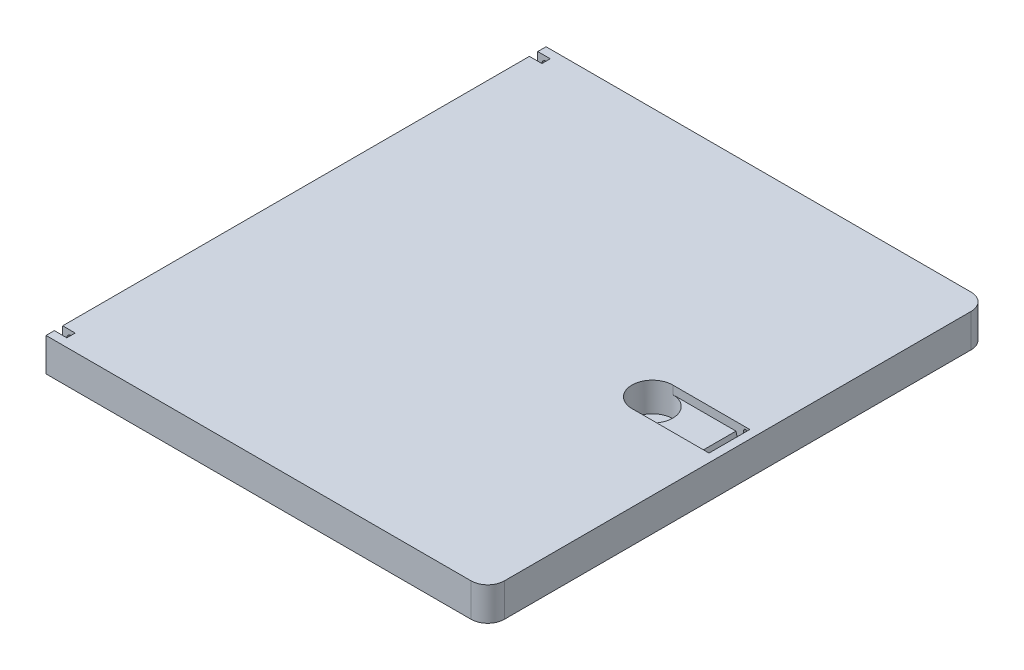
ISO-10303-21;
HEADER;
FILE_DESCRIPTION(('STEP AP214'),'2;1');
FILE_NAME('part.step','',(''),(''),'','','');
FILE_SCHEMA(('AUTOMOTIVE_DESIGN { 1 0 10303 214 1 1 1 1 }'));
ENDSEC;
DATA;
#1=APPLICATION_CONTEXT('core data for automotive mechanical design processes');
#2=APPLICATION_PROTOCOL_DEFINITION('international standard','automotive_design',2000,#1);
#3=PRODUCT_CONTEXT('',#1,'mechanical');
#4=PRODUCT('Part','Part','',(#3));
#5=PRODUCT_RELATED_PRODUCT_CATEGORY('part','',(#4));
#6=PRODUCT_DEFINITION_FORMATION('','',#4);
#7=PRODUCT_DEFINITION_CONTEXT('part definition',#1,'design');
#8=PRODUCT_DEFINITION('design','',#6,#7);
#9=PRODUCT_DEFINITION_SHAPE('','',#8);
#10=(LENGTH_UNIT() NAMED_UNIT(*) SI_UNIT(.MILLI.,.METRE.));
#11=(NAMED_UNIT(*) PLANE_ANGLE_UNIT() SI_UNIT($,.RADIAN.));
#12=(NAMED_UNIT(*) SI_UNIT($,.STERADIAN.) SOLID_ANGLE_UNIT());
#13=UNCERTAINTY_MEASURE_WITH_UNIT(LENGTH_MEASURE(1.E-05),#10,'distance_accuracy_value','');
#14=(GEOMETRIC_REPRESENTATION_CONTEXT(3) GLOBAL_UNCERTAINTY_ASSIGNED_CONTEXT((#13)) GLOBAL_UNIT_ASSIGNED_CONTEXT((#10,
#11,#12)) REPRESENTATION_CONTEXT('',''));
#15=CARTESIAN_POINT('',(0.,0.,0.));
#16=DIRECTION('',(0.,0.,1.));
#17=DIRECTION('',(1.,0.,0.));
#18=AXIS2_PLACEMENT_3D('',#15,#16,#17);
#19=CARTESIAN_POINT('',(0.,0.,-56.));
#20=DIRECTION('',(0.,0.,1.));
#21=DIRECTION('',(-1.,0.,0.));
#22=AXIS2_PLACEMENT_3D('',#19,#20,#21);
#23=PLANE('',#22);
#24=DIRECTION('',(0.,-1.,0.));
#25=VECTOR('',#24,1.);
#26=CARTESIAN_POINT('',(-103.,0.,-56.));
#27=LINE('',#26,#25);
#28=CARTESIAN_POINT('',(-103.,0.,-56.));
#29=VERTEX_POINT('',#28);
#30=CARTESIAN_POINT('',(-103.,-2.,-56.));
#31=VERTEX_POINT('',#30);
#32=EDGE_CURVE('E271',#29,#31,#27,.T.);
#33=ORIENTED_EDGE('',*,*,#32,.T.);
#34=CARTESIAN_POINT('',(-104.,-2.,-56.));
#35=DIRECTION('',(0.,0.,1.));
#36=DIRECTION('',(1.,0.,0.));
#37=AXIS2_PLACEMENT_3D('',#34,#35,#36);
#38=CIRCLE('',#37,0.999999999999998);
#39=CARTESIAN_POINT('',(-104.,-3.,-56.));
#40=VERTEX_POINT('',#39);
#41=EDGE_CURVE('E46',#31,#40,#38,.T.);
#42=ORIENTED_EDGE('',*,*,#41,.T.);
#43=DIRECTION('',(1.,0.,0.));
#44=VECTOR('',#43,1.);
#45=CARTESIAN_POINT('',(-106.,-3.,-56.));
#46=LINE('',#45,#44);
#47=CARTESIAN_POINT('',(-106.,-3.,-56.));
#48=VERTEX_POINT('',#47);
#49=EDGE_CURVE('E527',#48,#40,#46,.T.);
#50=ORIENTED_EDGE('',*,*,#49,.F.);
#51=DIRECTION('',(0.,-1.,0.));
#52=VECTOR('',#51,1.);
#53=CARTESIAN_POINT('',(-106.,0.,-56.));
#54=LINE('',#53,#52);
#55=CARTESIAN_POINT('',(-106.,0.,-56.));
#56=VERTEX_POINT('',#55);
#57=EDGE_CURVE('E264',#56,#48,#54,.T.);
#58=ORIENTED_EDGE('',*,*,#57,.F.);
#59=DIRECTION('',(1.,0.,0.));
#60=VECTOR('',#59,1.);
#61=CARTESIAN_POINT('',(-106.,0.,-56.));
#62=LINE('',#61,#60);
#63=EDGE_CURVE('E263',#56,#29,#62,.T.);
#64=ORIENTED_EDGE('',*,*,#63,.T.);
#65=EDGE_LOOP('',(#33,#42,#50,#58,#64));
#66=FACE_BOUND('',#65,.T.);
#67=ADVANCED_FACE('F32',(#66),#23,.F.);
#68=CARTESIAN_POINT('',(0.,0.,-58.));
#69=DIRECTION('',(0.,0.,1.));
#70=DIRECTION('',(-1.,0.,0.));
#71=AXIS2_PLACEMENT_3D('',#68,#69,#70);
#72=PLANE('',#71);
#73=CARTESIAN_POINT('',(-104.,-2.,-58.));
#74=DIRECTION('',(0.,0.,1.));
#75=DIRECTION('',(1.,0.,0.));
#76=AXIS2_PLACEMENT_3D('',#73,#74,#75);
#77=CIRCLE('',#76,0.999999999999998);
#78=CARTESIAN_POINT('',(-103.,-2.,-58.));
#79=VERTEX_POINT('',#78);
#80=CARTESIAN_POINT('',(-104.,-3.,-58.));
#81=VERTEX_POINT('',#80);
#82=EDGE_CURVE('E11',#79,#81,#77,.T.);
#83=ORIENTED_EDGE('',*,*,#82,.F.);
#84=DIRECTION('',(0.,-1.,0.));
#85=VECTOR('',#84,1.);
#86=CARTESIAN_POINT('',(-103.,0.,-58.));
#87=LINE('',#86,#85);
#88=CARTESIAN_POINT('',(-103.,0.,-58.));
#89=VERTEX_POINT('',#88);
#90=EDGE_CURVE('E247',#89,#79,#87,.T.);
#91=ORIENTED_EDGE('',*,*,#90,.F.);
#92=DIRECTION('',(1.,0.,0.));
#93=VECTOR('',#92,1.);
#94=CARTESIAN_POINT('',(-106.,0.,-58.));
#95=LINE('',#94,#93);
#96=CARTESIAN_POINT('',(-106.,0.,-58.));
#97=VERTEX_POINT('',#96);
#98=EDGE_CURVE('E535',#97,#89,#95,.T.);
#99=ORIENTED_EDGE('',*,*,#98,.F.);
#100=DIRECTION('',(0.,-1.,0.));
#101=VECTOR('',#100,1.);
#102=CARTESIAN_POINT('',(-106.,0.,-58.));
#103=LINE('',#102,#101);
#104=CARTESIAN_POINT('',(-106.,-3.,-58.));
#105=VERTEX_POINT('',#104);
#106=EDGE_CURVE('E536',#97,#105,#103,.T.);
#107=ORIENTED_EDGE('',*,*,#106,.T.);
#108=DIRECTION('',(1.,0.,0.));
#109=VECTOR('',#108,1.);
#110=CARTESIAN_POINT('',(-106.,-3.,-58.));
#111=LINE('',#110,#109);
#112=EDGE_CURVE('E250',#105,#81,#111,.T.);
#113=ORIENTED_EDGE('',*,*,#112,.T.);
#114=EDGE_LOOP('',(#83,#91,#99,#107,#113));
#115=FACE_BOUND('',#114,.T.);
#116=ADVANCED_FACE('F245',(#115),#72,.T.);
#117=CARTESIAN_POINT('',(0.,0.,56.));
#118=DIRECTION('',(0.,0.,-1.));
#119=DIRECTION('',(-1.,0.,0.));
#120=AXIS2_PLACEMENT_3D('',#117,#118,#119);
#121=PLANE('',#120);
#122=CARTESIAN_POINT('',(-104.,-2.,56.));
#123=DIRECTION('',(0.,0.,-1.));
#124=DIRECTION('',(-1.,0.,0.));
#125=AXIS2_PLACEMENT_3D('',#122,#123,#124);
#126=CIRCLE('',#125,0.999999999999998);
#127=CARTESIAN_POINT('',(-104.,-3.,56.));
#128=VERTEX_POINT('',#127);
#129=CARTESIAN_POINT('',(-103.,-2.,56.));
#130=VERTEX_POINT('',#129);
#131=EDGE_CURVE('E284',#128,#130,#126,.F.);
#132=ORIENTED_EDGE('',*,*,#131,.F.);
#133=DIRECTION('',(1.,0.,0.));
#134=VECTOR('',#133,1.);
#135=CARTESIAN_POINT('',(-106.,-3.,56.));
#136=LINE('',#135,#134);
#137=CARTESIAN_POINT('',(-103.,-3.,56.));
#138=VERTEX_POINT('',#137);
#139=EDGE_CURVE('E293',#128,#138,#136,.T.);
#140=ORIENTED_EDGE('',*,*,#139,.T.);
#141=DIRECTION('',(0.,-1.,0.));
#142=VECTOR('',#141,1.);
#143=CARTESIAN_POINT('',(-103.,0.,56.));
#144=LINE('',#143,#142);
#145=EDGE_CURVE('E288',#130,#138,#144,.T.);
#146=ORIENTED_EDGE('',*,*,#145,.F.);
#147=EDGE_LOOP('',(#132,#140,#146));
#148=FACE_BOUND('',#147,.T.);
#149=ADVANCED_FACE('F510',(#148),#121,.F.);
#150=CARTESIAN_POINT('',(0.,0.,58.));
#151=DIRECTION('',(0.,0.,-1.));
#152=DIRECTION('',(-1.,0.,0.));
#153=AXIS2_PLACEMENT_3D('',#150,#151,#152);
#154=PLANE('',#153);
#155=DIRECTION('',(1.,0.,0.));
#156=VECTOR('',#155,1.);
#157=CARTESIAN_POINT('',(-106.,-3.,58.));
#158=LINE('',#157,#156);
#159=CARTESIAN_POINT('',(-104.,-3.,58.));
#160=VERTEX_POINT('',#159);
#161=CARTESIAN_POINT('',(-103.,-3.,58.));
#162=VERTEX_POINT('',#161);
#163=EDGE_CURVE('E308',#160,#162,#158,.T.);
#164=ORIENTED_EDGE('',*,*,#163,.F.);
#165=CARTESIAN_POINT('',(-104.,-2.,58.));
#166=DIRECTION('',(0.,0.,-1.));
#167=DIRECTION('',(-1.,0.,0.));
#168=AXIS2_PLACEMENT_3D('',#165,#166,#167);
#169=CIRCLE('',#168,0.999999999999998);
#170=CARTESIAN_POINT('',(-103.,-2.,58.));
#171=VERTEX_POINT('',#170);
#172=EDGE_CURVE('E242',#160,#171,#169,.F.);
#173=ORIENTED_EDGE('',*,*,#172,.T.);
#174=DIRECTION('',(0.,-1.,0.));
#175=VECTOR('',#174,1.);
#176=CARTESIAN_POINT('',(-103.,0.,58.));
#177=LINE('',#176,#175);
#178=EDGE_CURVE('E304',#171,#162,#177,.T.);
#179=ORIENTED_EDGE('',*,*,#178,.T.);
#180=EDGE_LOOP('',(#164,#173,#179));
#181=FACE_BOUND('',#180,.T.);
#182=ADVANCED_FACE('F489',(#181),#154,.T.);
#183=CARTESIAN_POINT('',(0.,-8.,60.));
#184=DIRECTION('',(0.,0.,1.));
#185=DIRECTION('',(1.,0.,0.));
#186=AXIS2_PLACEMENT_3D('',#183,#184,#185);
#187=PLANE('',#186);
#188=DIRECTION('',(1.,0.,0.));
#189=VECTOR('',#188,1.);
#190=CARTESIAN_POINT('',(0.,-8.,60.));
#191=LINE('',#190,#189);
#192=CARTESIAN_POINT('',(-106.,-8.,60.));
#193=VERTEX_POINT('',#192);
#194=CARTESIAN_POINT('',(-4.,-8.,60.));
#195=VERTEX_POINT('',#194);
#196=EDGE_CURVE('E437',#193,#195,#191,.T.);
#197=ORIENTED_EDGE('',*,*,#196,.T.);
#198=DIRECTION('',(0.,1.,0.));
#199=VECTOR('',#198,1.);
#200=CARTESIAN_POINT('',(-4.,-8.,60.));
#201=LINE('',#200,#199);
#202=CARTESIAN_POINT('',(-4.,0.,60.));
#203=VERTEX_POINT('',#202);
#204=EDGE_CURVE('E455',#195,#203,#201,.T.);
#205=ORIENTED_EDGE('',*,*,#204,.T.);
#206=DIRECTION('',(1.,0.,0.));
#207=VECTOR('',#206,1.);
#208=CARTESIAN_POINT('',(0.,0.,60.));
#209=LINE('',#208,#207);
#210=CARTESIAN_POINT('',(-106.,0.,60.));
#211=VERTEX_POINT('',#210);
#212=EDGE_CURVE('E433',#211,#203,#209,.T.);
#213=ORIENTED_EDGE('',*,*,#212,.F.);
#214=DIRECTION('',(0.,1.,0.));
#215=VECTOR('',#214,1.);
#216=CARTESIAN_POINT('',(-106.,-8.,60.));
#217=LINE('',#216,#215);
#218=EDGE_CURVE('E452',#193,#211,#217,.T.);
#219=ORIENTED_EDGE('',*,*,#218,.F.);
#220=EDGE_LOOP('',(#197,#205,#213,#219));
#221=FACE_BOUND('',#220,.T.);
#222=ADVANCED_FACE('F680',(#221),#187,.T.);
#223=CARTESIAN_POINT('',(-106.,-8.,0.));
#224=DIRECTION('',(-1.,0.,0.));
#225=DIRECTION('',(0.,0.,1.));
#226=AXIS2_PLACEMENT_3D('',#223,#224,#225);
#227=PLANE('',#226);
#228=ORIENTED_EDGE('',*,*,#57,.T.);
#229=DIRECTION('',(0.,0.,-1.));
#230=VECTOR('',#229,1.);
#231=CARTESIAN_POINT('',(-106.,-3.,-56.));
#232=LINE('',#231,#230);
#233=EDGE_CURVE('E273',#48,#105,#232,.T.);
#234=ORIENTED_EDGE('',*,*,#233,.T.);
#235=ORIENTED_EDGE('',*,*,#106,.F.);
#236=DIRECTION('',(0.,0.,1.));
#237=VECTOR('',#236,1.);
#238=CARTESIAN_POINT('',(-106.,0.,0.));
#239=LINE('',#238,#237);
#240=CARTESIAN_POINT('',(-106.,0.,-60.));
#241=VERTEX_POINT('',#240);
#242=EDGE_CURVE('E446',#241,#97,#239,.T.);
#243=ORIENTED_EDGE('',*,*,#242,.F.);
#244=DIRECTION('',(0.,1.,0.));
#245=VECTOR('',#244,1.);
#246=CARTESIAN_POINT('',(-106.,-8.,-60.));
#247=LINE('',#246,#245);
#248=CARTESIAN_POINT('',(-106.,-8.,-60.));
#249=VERTEX_POINT('',#248);
#250=EDGE_CURVE('E440',#249,#241,#247,.T.);
#251=ORIENTED_EDGE('',*,*,#250,.F.);
#252=DIRECTION('',(0.,0.,1.));
#253=VECTOR('',#252,1.);
#254=CARTESIAN_POINT('',(-106.,-8.,0.));
#255=LINE('',#254,#253);
#256=EDGE_CURVE('E435',#249,#193,#255,.T.);
#257=ORIENTED_EDGE('',*,*,#256,.T.);
#258=ORIENTED_EDGE('',*,*,#218,.T.);
#259=CARTESIAN_POINT('',(-106.,0.,58.));
#260=VERTEX_POINT('',#259);
#261=EDGE_CURVE('E445',#260,#211,#239,.T.);
#262=ORIENTED_EDGE('',*,*,#261,.F.);
#263=DIRECTION('',(0.,-1.,0.));
#264=VECTOR('',#263,1.);
#265=CARTESIAN_POINT('',(-106.,0.,58.));
#266=LINE('',#265,#264);
#267=CARTESIAN_POINT('',(-106.,-3.,58.));
#268=VERTEX_POINT('',#267);
#269=EDGE_CURVE('E289',#260,#268,#266,.T.);
#270=ORIENTED_EDGE('',*,*,#269,.T.);
#271=DIRECTION('',(0.,0.,1.));
#272=VECTOR('',#271,1.);
#273=CARTESIAN_POINT('',(-106.,-3.,56.));
#274=LINE('',#273,#272);
#275=CARTESIAN_POINT('',(-106.,-3.,56.));
#276=VERTEX_POINT('',#275);
#277=EDGE_CURVE('E300',#276,#268,#274,.T.);
#278=ORIENTED_EDGE('',*,*,#277,.F.);
#279=DIRECTION('',(0.,-1.,0.));
#280=VECTOR('',#279,1.);
#281=CARTESIAN_POINT('',(-106.,0.,56.));
#282=LINE('',#281,#280);
#283=CARTESIAN_POINT('',(-106.,0.,56.));
#284=VERTEX_POINT('',#283);
#285=EDGE_CURVE('E297',#284,#276,#282,.T.);
#286=ORIENTED_EDGE('',*,*,#285,.F.);
#287=EDGE_CURVE('E449',#56,#284,#239,.T.);
#288=ORIENTED_EDGE('',*,*,#287,.F.);
#289=EDGE_LOOP('',(#228,#234,#235,#243,#251,#257,#258,#262,#270,#278,#286,#288));
#290=FACE_BOUND('',#289,.T.);
#291=ADVANCED_FACE('F517',(#290),#227,.T.);
#292=CARTESIAN_POINT('',(0.,-8.,-60.));
#293=DIRECTION('',(0.,0.,-1.));
#294=DIRECTION('',(-1.,0.,0.));
#295=AXIS2_PLACEMENT_3D('',#292,#293,#294);
#296=PLANE('',#295);
#297=DIRECTION('',(-1.,0.,0.));
#298=VECTOR('',#297,1.);
#299=CARTESIAN_POINT('',(0.,0.,-60.));
#300=LINE('',#299,#298);
#301=CARTESIAN_POINT('',(-4.,0.,-60.));
#302=VERTEX_POINT('',#301);
#303=EDGE_CURVE('E443',#302,#241,#300,.T.);
#304=ORIENTED_EDGE('',*,*,#303,.F.);
#305=DIRECTION('',(0.,1.,0.));
#306=VECTOR('',#305,1.);
#307=CARTESIAN_POINT('',(-4.,-8.,-60.));
#308=LINE('',#307,#306);
#309=CARTESIAN_POINT('',(-4.,-8.,-60.));
#310=VERTEX_POINT('',#309);
#311=EDGE_CURVE('E473',#302,#310,#308,.F.);
#312=ORIENTED_EDGE('',*,*,#311,.T.);
#313=DIRECTION('',(-1.,0.,0.));
#314=VECTOR('',#313,1.);
#315=CARTESIAN_POINT('',(0.,-8.,-60.));
#316=LINE('',#315,#314);
#317=EDGE_CURVE('E432',#310,#249,#316,.T.);
#318=ORIENTED_EDGE('',*,*,#317,.T.);
#319=ORIENTED_EDGE('',*,*,#250,.T.);
#320=EDGE_LOOP('',(#304,#312,#318,#319));
#321=FACE_BOUND('',#320,.T.);
#322=ADVANCED_FACE('F686',(#321),#296,.T.);
#323=CARTESIAN_POINT('',(0.,-8.,0.));
#324=DIRECTION('',(1.,0.,0.));
#325=DIRECTION('',(0.,0.,-1.));
#326=AXIS2_PLACEMENT_3D('',#323,#324,#325);
#327=PLANE('',#326);
#328=DIRECTION('',(0.,0.,-1.));
#329=VECTOR('',#328,1.);
#330=CARTESIAN_POINT('',(0.,0.,0.));
#331=LINE('',#330,#329);
#332=CARTESIAN_POINT('',(0.,0.,56.));
#333=VERTEX_POINT('',#332);
#334=CARTESIAN_POINT('',(0.,0.,-56.));
#335=VERTEX_POINT('',#334);
#336=EDGE_CURVE('E423',#333,#335,#331,.T.);
#337=ORIENTED_EDGE('',*,*,#336,.F.);
#338=DIRECTION('',(0.,1.,0.));
#339=VECTOR('',#338,1.);
#340=CARTESIAN_POINT('',(0.,-8.,56.));
#341=LINE('',#340,#339);
#342=CARTESIAN_POINT('',(0.,-8.,56.));
#343=VERTEX_POINT('',#342);
#344=EDGE_CURVE('E467',#333,#343,#341,.F.);
#345=ORIENTED_EDGE('',*,*,#344,.T.);
#346=DIRECTION('',(0.,0.,-1.));
#347=VECTOR('',#346,1.);
#348=CARTESIAN_POINT('',(0.,-8.,0.));
#349=LINE('',#348,#347);
#350=CARTESIAN_POINT('',(0.,-8.,-56.));
#351=VERTEX_POINT('',#350);
#352=EDGE_CURVE('E429',#343,#351,#349,.T.);
#353=ORIENTED_EDGE('',*,*,#352,.T.);
#354=DIRECTION('',(0.,1.,0.));
#355=VECTOR('',#354,1.);
#356=CARTESIAN_POINT('',(0.,-8.,-56.));
#357=LINE('',#356,#355);
#358=EDGE_CURVE('E464',#351,#335,#357,.T.);
#359=ORIENTED_EDGE('',*,*,#358,.T.);
#360=EDGE_LOOP('',(#337,#345,#353,#359));
#361=FACE_BOUND('',#360,.T.);
#362=ADVANCED_FACE('F674',(#361),#327,.T.);
#363=CARTESIAN_POINT('',(0.,-8.,0.));
#364=DIRECTION('',(0.,-1.,0.));
#365=DIRECTION('',(0.,0.,-1.));
#366=AXIS2_PLACEMENT_3D('',#363,#364,#365);
#367=PLANE('',#366);
#368=ORIENTED_EDGE('',*,*,#352,.F.);
#369=CARTESIAN_POINT('',(-4.,-8.,56.));
#370=DIRECTION('',(0.,-1.,0.));
#371=DIRECTION('',(0.,0.,-1.));
#372=AXIS2_PLACEMENT_3D('',#369,#370,#371);
#373=CIRCLE('',#372,4.);
#374=EDGE_CURVE('E471',#343,#195,#373,.T.);
#375=ORIENTED_EDGE('',*,*,#374,.T.);
#376=ORIENTED_EDGE('',*,*,#196,.F.);
#377=ORIENTED_EDGE('',*,*,#256,.F.);
#378=ORIENTED_EDGE('',*,*,#317,.F.);
#379=CARTESIAN_POINT('',(-4.,-8.,-56.));
#380=DIRECTION('',(0.,-1.,0.));
#381=DIRECTION('',(0.,0.,-1.));
#382=AXIS2_PLACEMENT_3D('',#379,#380,#381);
#383=CIRCLE('',#382,4.);
#384=EDGE_CURVE('E469',#310,#351,#383,.T.);
#385=ORIENTED_EDGE('',*,*,#384,.T.);
#386=EDGE_LOOP('',(#368,#375,#376,#377,#378,#385));
#387=FACE_BOUND('',#386,.T.);
#388=ADVANCED_FACE('F671',(#387),#367,.T.);
#389=CARTESIAN_POINT('',(0.,0.,0.));
#390=DIRECTION('',(0.,-1.,0.));
#391=DIRECTION('',(0.,0.,-1.));
#392=AXIS2_PLACEMENT_3D('',#389,#390,#391);
#393=PLANE('',#392);
#394=DIRECTION('',(0.,0.,-1.));
#395=VECTOR('',#394,1.);
#396=CARTESIAN_POINT('',(-2.,0.,0.));
#397=LINE('',#396,#395);
#398=CARTESIAN_POINT('',(-2.,0.,4.9));
#399=VERTEX_POINT('',#398);
#400=CARTESIAN_POINT('',(-2.,0.,-4.9));
#401=VERTEX_POINT('',#400);
#402=EDGE_CURVE('E401',#399,#401,#397,.T.);
#403=ORIENTED_EDGE('',*,*,#402,.F.);
#404=DIRECTION('',(1.,0.,0.));
#405=VECTOR('',#404,1.);
#406=CARTESIAN_POINT('',(-2.,0.,4.9));
#407=LINE('',#406,#405);
#408=CARTESIAN_POINT('',(-20.5,0.,4.9));
#409=VERTEX_POINT('',#408);
#410=EDGE_CURVE('E407',#409,#399,#407,.T.);
#411=ORIENTED_EDGE('',*,*,#410,.F.);
#412=CARTESIAN_POINT('',(-20.5,0.,0.));
#413=DIRECTION('',(0.,1.,0.));
#414=DIRECTION('',(0.,0.,1.));
#415=AXIS2_PLACEMENT_3D('',#412,#413,#414);
#416=CIRCLE('',#415,4.9);
#417=CARTESIAN_POINT('',(-20.5,0.,-4.9));
#418=VERTEX_POINT('',#417);
#419=EDGE_CURVE('E416',#418,#409,#416,.T.);
#420=ORIENTED_EDGE('',*,*,#419,.F.);
#421=DIRECTION('',(-1.,0.,0.));
#422=VECTOR('',#421,1.);
#423=CARTESIAN_POINT('',(-2.,0.,-4.9));
#424=LINE('',#423,#422);
#425=EDGE_CURVE('E413',#401,#418,#424,.T.);
#426=ORIENTED_EDGE('',*,*,#425,.F.);
#427=EDGE_LOOP('',(#403,#411,#420,#426));
#428=FACE_BOUND('',#427,.T.);
#429=DIRECTION('',(0.,0.,-1.));
#430=VECTOR('',#429,1.);
#431=CARTESIAN_POINT('',(-103.,0.,-56.));
#432=LINE('',#431,#430);
#433=EDGE_CURVE('E261',#29,#89,#432,.T.);
#434=ORIENTED_EDGE('',*,*,#433,.F.);
#435=ORIENTED_EDGE('',*,*,#63,.F.);
#436=ORIENTED_EDGE('',*,*,#287,.T.);
#437=DIRECTION('',(1.,0.,0.));
#438=VECTOR('',#437,1.);
#439=CARTESIAN_POINT('',(-106.,0.,56.));
#440=LINE('',#439,#438);
#441=CARTESIAN_POINT('',(-103.,0.,56.));
#442=VERTEX_POINT('',#441);
#443=EDGE_CURVE('E285',#284,#442,#440,.T.);
#444=ORIENTED_EDGE('',*,*,#443,.T.);
#445=DIRECTION('',(0.,0.,1.));
#446=VECTOR('',#445,1.);
#447=CARTESIAN_POINT('',(-103.,0.,56.));
#448=LINE('',#447,#446);
#449=CARTESIAN_POINT('',(-103.,0.,58.));
#450=VERTEX_POINT('',#449);
#451=EDGE_CURVE('E318',#442,#450,#448,.T.);
#452=ORIENTED_EDGE('',*,*,#451,.T.);
#453=DIRECTION('',(1.,0.,0.));
#454=VECTOR('',#453,1.);
#455=CARTESIAN_POINT('',(-106.,0.,58.));
#456=LINE('',#455,#454);
#457=EDGE_CURVE('E301',#260,#450,#456,.T.);
#458=ORIENTED_EDGE('',*,*,#457,.F.);
#459=ORIENTED_EDGE('',*,*,#261,.T.);
#460=ORIENTED_EDGE('',*,*,#212,.T.);
#461=CARTESIAN_POINT('',(-4.,0.,56.));
#462=DIRECTION('',(0.,-1.,0.));
#463=DIRECTION('',(0.,0.,-1.));
#464=AXIS2_PLACEMENT_3D('',#461,#462,#463);
#465=CIRCLE('',#464,4.);
#466=EDGE_CURVE('E462',#203,#333,#465,.F.);
#467=ORIENTED_EDGE('',*,*,#466,.T.);
#468=ORIENTED_EDGE('',*,*,#336,.T.);
#469=CARTESIAN_POINT('',(-4.,0.,-56.));
#470=DIRECTION('',(0.,-1.,0.));
#471=DIRECTION('',(0.,0.,-1.));
#472=AXIS2_PLACEMENT_3D('',#469,#470,#471);
#473=CIRCLE('',#472,4.);
#474=EDGE_CURVE('E460',#335,#302,#473,.F.);
#475=ORIENTED_EDGE('',*,*,#474,.T.);
#476=ORIENTED_EDGE('',*,*,#303,.T.);
#477=ORIENTED_EDGE('',*,*,#242,.T.);
#478=ORIENTED_EDGE('',*,*,#98,.T.);
#479=EDGE_LOOP('',(#434,#435,#436,#444,#452,#458,#459,#460,#467,#468,#475,#476,#477,#478));
#480=FACE_BOUND('',#479,.T.);
#481=ADVANCED_FACE('F499',(#428,#480),#393,.F.);
#482=CARTESIAN_POINT('',(-4.,-8.,56.));
#483=DIRECTION('',(0.,1.,0.));
#484=DIRECTION('',(0.,0.,1.));
#485=AXIS2_PLACEMENT_3D('',#482,#483,#484);
#486=CYLINDRICAL_SURFACE('',#485,4.);
#487=ORIENTED_EDGE('',*,*,#374,.F.);
#488=ORIENTED_EDGE('',*,*,#344,.F.);
#489=ORIENTED_EDGE('',*,*,#466,.F.);
#490=ORIENTED_EDGE('',*,*,#204,.F.);
#491=EDGE_LOOP('',(#487,#488,#489,#490));
#492=FACE_BOUND('',#491,.T.);
#493=ADVANCED_FACE('F678',(#492),#486,.T.);
#494=CARTESIAN_POINT('',(-4.,-8.,-56.));
#495=DIRECTION('',(0.,1.,0.));
#496=DIRECTION('',(0.,0.,1.));
#497=AXIS2_PLACEMENT_3D('',#494,#495,#496);
#498=CYLINDRICAL_SURFACE('',#497,4.);
#499=ORIENTED_EDGE('',*,*,#384,.F.);
#500=ORIENTED_EDGE('',*,*,#311,.F.);
#501=ORIENTED_EDGE('',*,*,#474,.F.);
#502=ORIENTED_EDGE('',*,*,#358,.F.);
#503=EDGE_LOOP('',(#499,#500,#501,#502));
#504=FACE_BOUND('',#503,.T.);
#505=ADVANCED_FACE('F659',(#504),#498,.T.);
#506=CARTESIAN_POINT('',(-2.,-2.,4.9));
#507=DIRECTION('',(0.,0.,1.));
#508=DIRECTION('',(1.,0.,0.));
#509=AXIS2_PLACEMENT_3D('',#506,#507,#508);
#510=PLANE('',#509);
#511=DIRECTION('',(0.,-1.,0.));
#512=VECTOR('',#511,1.);
#513=CARTESIAN_POINT('',(-2.5,-1.,4.9));
#514=LINE('',#513,#512);
#515=CARTESIAN_POINT('',(-2.5,-1.,4.9));
#516=VERTEX_POINT('',#515);
#517=CARTESIAN_POINT('',(-2.5,-6.,4.9));
#518=VERTEX_POINT('',#517);
#519=EDGE_CURVE('E337',#516,#518,#514,.T.);
#520=ORIENTED_EDGE('',*,*,#519,.F.);
#521=CARTESIAN_POINT('',(-3.,-1.,4.9));
#522=DIRECTION('',(0.,0.,-1.));
#523=DIRECTION('',(-1.,0.,0.));
#524=AXIS2_PLACEMENT_3D('',#521,#522,#523);
#525=CIRCLE('',#524,0.5);
#526=CARTESIAN_POINT('',(-3.5,-1.,4.9));
#527=VERTEX_POINT('',#526);
#528=EDGE_CURVE('E321',#527,#516,#525,.T.);
#529=ORIENTED_EDGE('',*,*,#528,.F.);
#530=DIRECTION('',(0.,1.,0.));
#531=VECTOR('',#530,1.);
#532=CARTESIAN_POINT('',(-3.5,-1.,4.9));
#533=LINE('',#532,#531);
#534=CARTESIAN_POINT('',(-3.5,-6.,4.9));
#535=VERTEX_POINT('',#534);
#536=EDGE_CURVE('E326',#535,#527,#533,.T.);
#537=ORIENTED_EDGE('',*,*,#536,.F.);
#538=CARTESIAN_POINT('',(-3.,-6.,4.9));
#539=DIRECTION('',(0.,0.,-1.));
#540=DIRECTION('',(-1.,0.,0.));
#541=AXIS2_PLACEMENT_3D('',#538,#539,#540);
#542=CIRCLE('',#541,0.5);
#543=EDGE_CURVE('E340',#518,#535,#542,.T.);
#544=ORIENTED_EDGE('',*,*,#543,.F.);
#545=EDGE_LOOP('',(#520,#529,#537,#544));
#546=FACE_BOUND('',#545,.T.);
#547=ORIENTED_EDGE('',*,*,#410,.T.);
#548=DIRECTION('',(0.,1.,0.));
#549=VECTOR('',#548,1.);
#550=CARTESIAN_POINT('',(-2.,-2.,4.9));
#551=LINE('',#550,#549);
#552=CARTESIAN_POINT('',(-2.,-7.,4.9));
#553=VERTEX_POINT('',#552);
#554=EDGE_CURVE('E420',#553,#399,#551,.T.);
#555=ORIENTED_EDGE('',*,*,#554,.F.);
#556=DIRECTION('',(1.,0.,0.));
#557=VECTOR('',#556,1.);
#558=CARTESIAN_POINT('',(-2.,-7.,4.9));
#559=LINE('',#558,#557);
#560=CARTESIAN_POINT('',(-4.,-7.,4.9));
#561=VERTEX_POINT('',#560);
#562=EDGE_CURVE('E394',#561,#553,#559,.T.);
#563=ORIENTED_EDGE('',*,*,#562,.F.);
#564=DIRECTION('',(-0.258819045102518,0.965925826289069,0.));
#565=VECTOR('',#564,1.);
#566=CARTESIAN_POINT('',(-5.11602540378444,-2.83493649053889,4.9));
#567=LINE('',#566,#565);
#568=CARTESIAN_POINT('',(-5.33974596215561,-2.,4.9));
#569=VERTEX_POINT('',#568);
#570=EDGE_CURVE('E477',#561,#569,#567,.T.);
#571=ORIENTED_EDGE('',*,*,#570,.T.);
#572=DIRECTION('',(1.,0.,0.));
#573=VECTOR('',#572,1.);
#574=CARTESIAN_POINT('',(-2.,-2.,4.9));
#575=LINE('',#574,#573);
#576=CARTESIAN_POINT('',(-20.5,-2.,4.9));
#577=VERTEX_POINT('',#576);
#578=EDGE_CURVE('E406',#577,#569,#575,.T.);
#579=ORIENTED_EDGE('',*,*,#578,.F.);
#580=DIRECTION('',(0.,1.,0.));
#581=VECTOR('',#580,1.);
#582=CARTESIAN_POINT('',(-20.5,-2.,4.9));
#583=LINE('',#582,#581);
#584=EDGE_CURVE('E424',#577,#409,#583,.T.);
#585=ORIENTED_EDGE('',*,*,#584,.T.);
#586=EDGE_LOOP('',(#547,#555,#563,#571,#579,#585));
#587=FACE_BOUND('',#586,.T.);
#588=ADVANCED_FACE('F655',(#546,#587),#510,.F.);
#589=CARTESIAN_POINT('',(-20.5,-2.,0.));
#590=DIRECTION('',(0.,1.,0.));
#591=DIRECTION('',(0.,0.,1.));
#592=AXIS2_PLACEMENT_3D('',#589,#590,#591);
#593=CYLINDRICAL_SURFACE('',#592,4.9);
#594=ORIENTED_EDGE('',*,*,#419,.T.);
#595=ORIENTED_EDGE('',*,*,#584,.F.);
#596=CARTESIAN_POINT('',(-20.5,-2.,0.));
#597=DIRECTION('',(0.,1.,0.));
#598=DIRECTION('',(0.,0.,1.));
#599=AXIS2_PLACEMENT_3D('',#596,#597,#598);
#600=CIRCLE('',#599,4.9);
#601=CARTESIAN_POINT('',(-20.5,-2.,-4.9));
#602=VERTEX_POINT('',#601);
#603=EDGE_CURVE('E397',#577,#602,#600,.T.);
#604=ORIENTED_EDGE('',*,*,#603,.T.);
#605=DIRECTION('',(0.,1.,0.));
#606=VECTOR('',#605,1.);
#607=CARTESIAN_POINT('',(-20.5,-2.,-4.9));
#608=LINE('',#607,#606);
#609=EDGE_CURVE('E426',#602,#418,#608,.T.);
#610=ORIENTED_EDGE('',*,*,#609,.T.);
#611=EDGE_LOOP('',(#594,#595,#604,#610));
#612=FACE_BOUND('',#611,.T.);
#613=CARTESIAN_POINT('',(-20.5,-7.,0.));
#614=DIRECTION('',(0.,1.,0.));
#615=DIRECTION('',(0.,0.,1.));
#616=AXIS2_PLACEMENT_3D('',#613,#614,#615);
#617=CIRCLE('',#616,4.9);
#618=CARTESIAN_POINT('',(-20.5,-7.,4.9));
#619=VERTEX_POINT('',#618);
#620=EDGE_CURVE('E398',#619,#619,#617,.T.);
#621=ORIENTED_EDGE('',*,*,#620,.F.);
#622=EDGE_LOOP('',(#621));
#623=FACE_BOUND('',#622,.T.);
#624=ADVANCED_FACE('F658',(#612,#623),#593,.F.);
#625=CARTESIAN_POINT('',(-2.,-2.,-4.9));
#626=DIRECTION('',(0.,0.,-1.));
#627=DIRECTION('',(-1.,0.,0.));
#628=AXIS2_PLACEMENT_3D('',#625,#626,#627);
#629=PLANE('',#628);
#630=DIRECTION('',(0.,-1.,0.));
#631=VECTOR('',#630,1.);
#632=CARTESIAN_POINT('',(-3.5,-1.,-4.9));
#633=LINE('',#632,#631);
#634=CARTESIAN_POINT('',(-3.5,-1.,-4.9));
#635=VERTEX_POINT('',#634);
#636=CARTESIAN_POINT('',(-3.5,-6.,-4.9));
#637=VERTEX_POINT('',#636);
#638=EDGE_CURVE('E369',#635,#637,#633,.T.);
#639=ORIENTED_EDGE('',*,*,#638,.F.);
#640=CARTESIAN_POINT('',(-3.,-1.,-4.9));
#641=DIRECTION('',(0.,0.,1.));
#642=DIRECTION('',(1.,0.,0.));
#643=AXIS2_PLACEMENT_3D('',#640,#641,#642);
#644=CIRCLE('',#643,0.5);
#645=CARTESIAN_POINT('',(-2.5,-1.,-4.9));
#646=VERTEX_POINT('',#645);
#647=EDGE_CURVE('E347',#646,#635,#644,.T.);
#648=ORIENTED_EDGE('',*,*,#647,.F.);
#649=DIRECTION('',(0.,1.,0.));
#650=VECTOR('',#649,1.);
#651=CARTESIAN_POINT('',(-2.5,-6.,-4.9));
#652=LINE('',#651,#650);
#653=CARTESIAN_POINT('',(-2.5,-6.,-4.9));
#654=VERTEX_POINT('',#653);
#655=EDGE_CURVE('E358',#654,#646,#652,.T.);
#656=ORIENTED_EDGE('',*,*,#655,.F.);
#657=CARTESIAN_POINT('',(-3.,-6.,-4.9));
#658=DIRECTION('',(0.,0.,1.));
#659=DIRECTION('',(1.,0.,0.));
#660=AXIS2_PLACEMENT_3D('',#657,#658,#659);
#661=CIRCLE('',#660,0.5);
#662=EDGE_CURVE('E372',#637,#654,#661,.T.);
#663=ORIENTED_EDGE('',*,*,#662,.F.);
#664=EDGE_LOOP('',(#639,#648,#656,#663));
#665=FACE_BOUND('',#664,.T.);
#666=ORIENTED_EDGE('',*,*,#425,.T.);
#667=ORIENTED_EDGE('',*,*,#609,.F.);
#668=DIRECTION('',(-1.,0.,0.));
#669=VECTOR('',#668,1.);
#670=CARTESIAN_POINT('',(-2.,-2.,-4.9));
#671=LINE('',#670,#669);
#672=CARTESIAN_POINT('',(-5.33974596215561,-2.,-4.9));
#673=VERTEX_POINT('',#672);
#674=EDGE_CURVE('E404',#673,#602,#671,.T.);
#675=ORIENTED_EDGE('',*,*,#674,.F.);
#676=DIRECTION('',(0.258819045102518,-0.965925826289069,0.));
#677=VECTOR('',#676,1.);
#678=CARTESIAN_POINT('',(-5.11602540378444,-2.83493649053889,-4.9));
#679=LINE('',#678,#677);
#680=CARTESIAN_POINT('',(-4.,-7.,-4.9));
#681=VERTEX_POINT('',#680);
#682=EDGE_CURVE('E479',#673,#681,#679,.T.);
#683=ORIENTED_EDGE('',*,*,#682,.T.);
#684=DIRECTION('',(-1.,0.,0.));
#685=VECTOR('',#684,1.);
#686=CARTESIAN_POINT('',(-2.,-7.,-4.9));
#687=LINE('',#686,#685);
#688=CARTESIAN_POINT('',(-2.,-7.,-4.9));
#689=VERTEX_POINT('',#688);
#690=EDGE_CURVE('E388',#689,#681,#687,.T.);
#691=ORIENTED_EDGE('',*,*,#690,.F.);
#692=DIRECTION('',(0.,1.,0.));
#693=VECTOR('',#692,1.);
#694=CARTESIAN_POINT('',(-2.,-2.,-4.9));
#695=LINE('',#694,#693);
#696=EDGE_CURVE('E410',#689,#401,#695,.T.);
#697=ORIENTED_EDGE('',*,*,#696,.T.);
#698=EDGE_LOOP('',(#666,#667,#675,#683,#691,#697));
#699=FACE_BOUND('',#698,.T.);
#700=ADVANCED_FACE('F663',(#665,#699),#629,.F.);
#701=CARTESIAN_POINT('',(-2.,-2.,0.));
#702=DIRECTION('',(1.,0.,0.));
#703=DIRECTION('',(0.,0.,-1.));
#704=AXIS2_PLACEMENT_3D('',#701,#702,#703);
#705=PLANE('',#704);
#706=ORIENTED_EDGE('',*,*,#402,.T.);
#707=ORIENTED_EDGE('',*,*,#696,.F.);
#708=DIRECTION('',(0.,0.,-1.));
#709=VECTOR('',#708,1.);
#710=CARTESIAN_POINT('',(-2.,-7.,-4.9));
#711=LINE('',#710,#709);
#712=EDGE_CURVE('E379',#553,#689,#711,.T.);
#713=ORIENTED_EDGE('',*,*,#712,.F.);
#714=ORIENTED_EDGE('',*,*,#554,.T.);
#715=EDGE_LOOP('',(#706,#707,#713,#714));
#716=FACE_BOUND('',#715,.T.);
#717=ADVANCED_FACE('F653',(#716),#705,.F.);
#718=CARTESIAN_POINT('',(-20.5,-2.,0.));
#719=DIRECTION('',(0.,1.,0.));
#720=DIRECTION('',(0.,0.,1.));
#721=AXIS2_PLACEMENT_3D('',#718,#719,#720);
#722=PLANE('',#721);
#723=ORIENTED_EDGE('',*,*,#578,.T.);
#724=DIRECTION('',(0.,0.,-1.));
#725=VECTOR('',#724,1.);
#726=CARTESIAN_POINT('',(-5.33974596215561,-2.,-4.9));
#727=LINE('',#726,#725);
#728=EDGE_CURVE('E475',#569,#673,#727,.T.);
#729=ORIENTED_EDGE('',*,*,#728,.T.);
#730=ORIENTED_EDGE('',*,*,#674,.T.);
#731=ORIENTED_EDGE('',*,*,#603,.F.);
#732=EDGE_LOOP('',(#723,#729,#730,#731));
#733=FACE_BOUND('',#732,.T.);
#734=ADVANCED_FACE('F649',(#733),#722,.T.);
#735=CARTESIAN_POINT('',(-20.5,-7.,0.));
#736=DIRECTION('',(0.,1.,0.));
#737=DIRECTION('',(0.,0.,1.));
#738=AXIS2_PLACEMENT_3D('',#735,#736,#737);
#739=PLANE('',#738);
#740=ORIENTED_EDGE('',*,*,#620,.T.);
#741=EDGE_LOOP('',(#740));
#742=FACE_BOUND('',#741,.T.);
#743=ADVANCED_FACE('F645',(#742),#739,.T.);
#744=CARTESIAN_POINT('',(0.,-7.,0.));
#745=DIRECTION('',(0.,-1.,0.));
#746=DIRECTION('',(0.,0.,-1.));
#747=AXIS2_PLACEMENT_3D('',#744,#745,#746);
#748=PLANE('',#747);
#749=ORIENTED_EDGE('',*,*,#712,.T.);
#750=ORIENTED_EDGE('',*,*,#690,.T.);
#751=DIRECTION('',(0.,0.,1.));
#752=VECTOR('',#751,1.);
#753=CARTESIAN_POINT('',(-4.,-7.,-4.9));
#754=LINE('',#753,#752);
#755=EDGE_CURVE('E391',#681,#561,#754,.T.);
#756=ORIENTED_EDGE('',*,*,#755,.T.);
#757=ORIENTED_EDGE('',*,*,#562,.T.);
#758=EDGE_LOOP('',(#749,#750,#756,#757));
#759=FACE_BOUND('',#758,.T.);
#760=ADVANCED_FACE('F641',(#759),#748,.F.);
#761=CARTESIAN_POINT('',(-3.,-1.,-6.9));
#762=DIRECTION('',(0.,0.,1.));
#763=DIRECTION('',(1.,0.,0.));
#764=AXIS2_PLACEMENT_3D('',#761,#762,#763);
#765=CYLINDRICAL_SURFACE('',#764,0.5);
#766=ORIENTED_EDGE('',*,*,#647,.T.);
#767=DIRECTION('',(0.,0.,1.));
#768=VECTOR('',#767,1.);
#769=CARTESIAN_POINT('',(-3.5,-1.,-6.9));
#770=LINE('',#769,#768);
#771=CARTESIAN_POINT('',(-3.5,-1.,-6.9));
#772=VERTEX_POINT('',#771);
#773=EDGE_CURVE('E367',#772,#635,#770,.T.);
#774=ORIENTED_EDGE('',*,*,#773,.F.);
#775=CARTESIAN_POINT('',(-3.,-1.,-6.9));
#776=DIRECTION('',(0.,0.,1.));
#777=DIRECTION('',(1.,0.,0.));
#778=AXIS2_PLACEMENT_3D('',#775,#776,#777);
#779=CIRCLE('',#778,0.5);
#780=CARTESIAN_POINT('',(-2.5,-1.,-6.9));
#781=VERTEX_POINT('',#780);
#782=EDGE_CURVE('E354',#781,#772,#779,.T.);
#783=ORIENTED_EDGE('',*,*,#782,.F.);
#784=DIRECTION('',(0.,0.,1.));
#785=VECTOR('',#784,1.);
#786=CARTESIAN_POINT('',(-2.5,-1.,-6.9));
#787=LINE('',#786,#785);
#788=EDGE_CURVE('E377',#781,#646,#787,.T.);
#789=ORIENTED_EDGE('',*,*,#788,.T.);
#790=EDGE_LOOP('',(#766,#774,#783,#789));
#791=FACE_BOUND('',#790,.T.);
#792=ADVANCED_FACE('F631',(#791),#765,.F.);
#793=CARTESIAN_POINT('',(-2.5,-6.,-6.9));
#794=DIRECTION('',(1.,0.,0.));
#795=DIRECTION('',(0.,0.,-1.));
#796=AXIS2_PLACEMENT_3D('',#793,#794,#795);
#797=PLANE('',#796);
#798=ORIENTED_EDGE('',*,*,#655,.T.);
#799=ORIENTED_EDGE('',*,*,#788,.F.);
#800=DIRECTION('',(0.,1.,0.));
#801=VECTOR('',#800,1.);
#802=CARTESIAN_POINT('',(-2.5,-6.,-6.9));
#803=LINE('',#802,#801);
#804=CARTESIAN_POINT('',(-2.5,-6.,-6.9));
#805=VERTEX_POINT('',#804);
#806=EDGE_CURVE('E364',#805,#781,#803,.T.);
#807=ORIENTED_EDGE('',*,*,#806,.F.);
#808=DIRECTION('',(0.,0.,1.));
#809=VECTOR('',#808,1.);
#810=CARTESIAN_POINT('',(-2.5,-6.,-6.9));
#811=LINE('',#810,#809);
#812=EDGE_CURVE('E380',#805,#654,#811,.T.);
#813=ORIENTED_EDGE('',*,*,#812,.T.);
#814=EDGE_LOOP('',(#798,#799,#807,#813));
#815=FACE_BOUND('',#814,.T.);
#816=ADVANCED_FACE('F627',(#815),#797,.F.);
#817=CARTESIAN_POINT('',(-3.,-6.,-6.9));
#818=DIRECTION('',(0.,0.,1.));
#819=DIRECTION('',(1.,0.,0.));
#820=AXIS2_PLACEMENT_3D('',#817,#818,#819);
#821=CYLINDRICAL_SURFACE('',#820,0.5);
#822=ORIENTED_EDGE('',*,*,#662,.T.);
#823=ORIENTED_EDGE('',*,*,#812,.F.);
#824=CARTESIAN_POINT('',(-3.,-6.,-6.9));
#825=DIRECTION('',(0.,0.,1.));
#826=DIRECTION('',(1.,0.,0.));
#827=AXIS2_PLACEMENT_3D('',#824,#825,#826);
#828=CIRCLE('',#827,0.5);
#829=CARTESIAN_POINT('',(-3.5,-6.,-6.9));
#830=VERTEX_POINT('',#829);
#831=EDGE_CURVE('E361',#830,#805,#828,.T.);
#832=ORIENTED_EDGE('',*,*,#831,.F.);
#833=DIRECTION('',(0.,0.,1.));
#834=VECTOR('',#833,1.);
#835=CARTESIAN_POINT('',(-3.5,-6.,-6.9));
#836=LINE('',#835,#834);
#837=EDGE_CURVE('E382',#830,#637,#836,.T.);
#838=ORIENTED_EDGE('',*,*,#837,.T.);
#839=EDGE_LOOP('',(#822,#823,#832,#838));
#840=FACE_BOUND('',#839,.T.);
#841=ADVANCED_FACE('F630',(#840),#821,.F.);
#842=CARTESIAN_POINT('',(-3.5,-1.,-6.9));
#843=DIRECTION('',(-1.,0.,0.));
#844=DIRECTION('',(0.,0.,1.));
#845=AXIS2_PLACEMENT_3D('',#842,#843,#844);
#846=PLANE('',#845);
#847=ORIENTED_EDGE('',*,*,#638,.T.);
#848=ORIENTED_EDGE('',*,*,#837,.F.);
#849=DIRECTION('',(0.,-1.,0.));
#850=VECTOR('',#849,1.);
#851=CARTESIAN_POINT('',(-3.5,-1.,-6.9));
#852=LINE('',#851,#850);
#853=EDGE_CURVE('E357',#772,#830,#852,.T.);
#854=ORIENTED_EDGE('',*,*,#853,.F.);
#855=ORIENTED_EDGE('',*,*,#773,.T.);
#856=EDGE_LOOP('',(#847,#848,#854,#855));
#857=FACE_BOUND('',#856,.T.);
#858=ADVANCED_FACE('F625',(#857),#846,.F.);
#859=CARTESIAN_POINT('',(-3.,-1.,-6.9));
#860=DIRECTION('',(0.,0.,1.));
#861=DIRECTION('',(1.,0.,0.));
#862=AXIS2_PLACEMENT_3D('',#859,#860,#861);
#863=PLANE('',#862);
#864=ORIENTED_EDGE('',*,*,#782,.T.);
#865=ORIENTED_EDGE('',*,*,#853,.T.);
#866=ORIENTED_EDGE('',*,*,#831,.T.);
#867=ORIENTED_EDGE('',*,*,#806,.T.);
#868=EDGE_LOOP('',(#864,#865,#866,#867));
#869=FACE_BOUND('',#868,.T.);
#870=ADVANCED_FACE('F621',(#869),#863,.T.);
#871=CARTESIAN_POINT('',(-3.,-1.,6.9));
#872=DIRECTION('',(0.,0.,-1.));
#873=DIRECTION('',(-1.,0.,0.));
#874=AXIS2_PLACEMENT_3D('',#871,#872,#873);
#875=CYLINDRICAL_SURFACE('',#874,0.5);
#876=ORIENTED_EDGE('',*,*,#528,.T.);
#877=DIRECTION('',(0.,0.,-1.));
#878=VECTOR('',#877,1.);
#879=CARTESIAN_POINT('',(-2.5,-1.,6.9));
#880=LINE('',#879,#878);
#881=CARTESIAN_POINT('',(-2.5,-1.,6.9));
#882=VERTEX_POINT('',#881);
#883=EDGE_CURVE('E335',#882,#516,#880,.T.);
#884=ORIENTED_EDGE('',*,*,#883,.F.);
#885=CARTESIAN_POINT('',(-3.,-1.,6.9));
#886=DIRECTION('',(0.,0.,-1.));
#887=DIRECTION('',(-1.,0.,0.));
#888=AXIS2_PLACEMENT_3D('',#885,#886,#887);
#889=CIRCLE('',#888,0.5);
#890=CARTESIAN_POINT('',(-3.5,-1.,6.9));
#891=VERTEX_POINT('',#890);
#892=EDGE_CURVE('E322',#891,#882,#889,.T.);
#893=ORIENTED_EDGE('',*,*,#892,.F.);
#894=DIRECTION('',(0.,0.,-1.));
#895=VECTOR('',#894,1.);
#896=CARTESIAN_POINT('',(-3.5,-1.,6.9));
#897=LINE('',#896,#895);
#898=EDGE_CURVE('E345',#891,#527,#897,.T.);
#899=ORIENTED_EDGE('',*,*,#898,.T.);
#900=EDGE_LOOP('',(#876,#884,#893,#899));
#901=FACE_BOUND('',#900,.T.);
#902=ADVANCED_FACE('F611',(#901),#875,.F.);
#903=CARTESIAN_POINT('',(-3.5,-1.,6.9));
#904=DIRECTION('',(-1.,0.,0.));
#905=DIRECTION('',(0.,0.,1.));
#906=AXIS2_PLACEMENT_3D('',#903,#904,#905);
#907=PLANE('',#906);
#908=ORIENTED_EDGE('',*,*,#536,.T.);
#909=ORIENTED_EDGE('',*,*,#898,.F.);
#910=DIRECTION('',(0.,1.,0.));
#911=VECTOR('',#910,1.);
#912=CARTESIAN_POINT('',(-3.5,-1.,6.9));
#913=LINE('',#912,#911);
#914=CARTESIAN_POINT('',(-3.5,-6.,6.9));
#915=VERTEX_POINT('',#914);
#916=EDGE_CURVE('E332',#915,#891,#913,.T.);
#917=ORIENTED_EDGE('',*,*,#916,.F.);
#918=DIRECTION('',(0.,0.,-1.));
#919=VECTOR('',#918,1.);
#920=CARTESIAN_POINT('',(-3.5,-6.,6.9));
#921=LINE('',#920,#919);
#922=EDGE_CURVE('E348',#915,#535,#921,.T.);
#923=ORIENTED_EDGE('',*,*,#922,.T.);
#924=EDGE_LOOP('',(#908,#909,#917,#923));
#925=FACE_BOUND('',#924,.T.);
#926=ADVANCED_FACE('F607',(#925),#907,.F.);
#927=CARTESIAN_POINT('',(-3.,-6.,6.9));
#928=DIRECTION('',(0.,0.,-1.));
#929=DIRECTION('',(-1.,0.,0.));
#930=AXIS2_PLACEMENT_3D('',#927,#928,#929);
#931=CYLINDRICAL_SURFACE('',#930,0.5);
#932=ORIENTED_EDGE('',*,*,#543,.T.);
#933=ORIENTED_EDGE('',*,*,#922,.F.);
#934=CARTESIAN_POINT('',(-3.,-6.,6.9));
#935=DIRECTION('',(0.,0.,-1.));
#936=DIRECTION('',(-1.,0.,0.));
#937=AXIS2_PLACEMENT_3D('',#934,#935,#936);
#938=CIRCLE('',#937,0.5);
#939=CARTESIAN_POINT('',(-2.5,-6.,6.9));
#940=VERTEX_POINT('',#939);
#941=EDGE_CURVE('E329',#940,#915,#938,.T.);
#942=ORIENTED_EDGE('',*,*,#941,.F.);
#943=DIRECTION('',(0.,0.,-1.));
#944=VECTOR('',#943,1.);
#945=CARTESIAN_POINT('',(-2.5,-6.,6.9));
#946=LINE('',#945,#944);
#947=EDGE_CURVE('E350',#940,#518,#946,.T.);
#948=ORIENTED_EDGE('',*,*,#947,.T.);
#949=EDGE_LOOP('',(#932,#933,#942,#948));
#950=FACE_BOUND('',#949,.T.);
#951=ADVANCED_FACE('F610',(#950),#931,.F.);
#952=CARTESIAN_POINT('',(-2.5,-1.,6.9));
#953=DIRECTION('',(1.,0.,0.));
#954=DIRECTION('',(0.,0.,-1.));
#955=AXIS2_PLACEMENT_3D('',#952,#953,#954);
#956=PLANE('',#955);
#957=ORIENTED_EDGE('',*,*,#519,.T.);
#958=ORIENTED_EDGE('',*,*,#947,.F.);
#959=DIRECTION('',(0.,-1.,0.));
#960=VECTOR('',#959,1.);
#961=CARTESIAN_POINT('',(-2.5,-1.,6.9));
#962=LINE('',#961,#960);
#963=EDGE_CURVE('E325',#882,#940,#962,.T.);
#964=ORIENTED_EDGE('',*,*,#963,.F.);
#965=ORIENTED_EDGE('',*,*,#883,.T.);
#966=EDGE_LOOP('',(#957,#958,#964,#965));
#967=FACE_BOUND('',#966,.T.);
#968=ADVANCED_FACE('F605',(#967),#956,.F.);
#969=CARTESIAN_POINT('',(-3.,-1.,6.9));
#970=DIRECTION('',(0.,0.,-1.));
#971=DIRECTION('',(-1.,0.,0.));
#972=AXIS2_PLACEMENT_3D('',#969,#970,#971);
#973=PLANE('',#972);
#974=ORIENTED_EDGE('',*,*,#892,.T.);
#975=ORIENTED_EDGE('',*,*,#963,.T.);
#976=ORIENTED_EDGE('',*,*,#941,.T.);
#977=ORIENTED_EDGE('',*,*,#916,.T.);
#978=EDGE_LOOP('',(#974,#975,#976,#977));
#979=FACE_BOUND('',#978,.T.);
#980=ADVANCED_FACE('F602',(#979),#973,.T.);
#981=CARTESIAN_POINT('',(-4.,-7.00000000000003,-4.9));
#982=DIRECTION('',(0.965925826289069,0.258819045102518,0.));
#983=DIRECTION('',(0.,0.,-1.));
#984=AXIS2_PLACEMENT_3D('',#981,#982,#983);
#985=PLANE('',#984);
#986=ORIENTED_EDGE('',*,*,#682,.F.);
#987=ORIENTED_EDGE('',*,*,#728,.F.);
#988=ORIENTED_EDGE('',*,*,#570,.F.);
#989=ORIENTED_EDGE('',*,*,#755,.F.);
#990=EDGE_LOOP('',(#986,#987,#988,#989));
#991=FACE_BOUND('',#990,.T.);
#992=ADVANCED_FACE('F34',(#991),#985,.T.);
#993=CARTESIAN_POINT('',(-103.,0.,56.));
#994=DIRECTION('',(-1.,0.,0.));
#995=DIRECTION('',(0.,0.,1.));
#996=AXIS2_PLACEMENT_3D('',#993,#994,#995);
#997=PLANE('',#996);
#998=ORIENTED_EDGE('',*,*,#178,.F.);
#999=EDGE_CURVE('E305',#450,#171,#177,.T.);
#1000=ORIENTED_EDGE('',*,*,#999,.F.);
#1001=ORIENTED_EDGE('',*,*,#451,.F.);
#1002=EDGE_CURVE('E290',#442,#130,#144,.T.);
#1003=ORIENTED_EDGE('',*,*,#1002,.T.);
#1004=ORIENTED_EDGE('',*,*,#145,.T.);
#1005=DIRECTION('',(0.,0.,1.));
#1006=VECTOR('',#1005,1.);
#1007=CARTESIAN_POINT('',(-103.,-3.,56.));
#1008=LINE('',#1007,#1006);
#1009=EDGE_CURVE('E315',#138,#162,#1008,.T.);
#1010=ORIENTED_EDGE('',*,*,#1009,.T.);
#1011=EDGE_LOOP('',(#998,#1000,#1001,#1003,#1004,#1010));
#1012=FACE_BOUND('',#1011,.T.);
#1013=ADVANCED_FACE('F492',(#1012),#997,.T.);
#1014=CARTESIAN_POINT('',(-106.,-3.,56.));
#1015=DIRECTION('',(0.,-1.,0.));
#1016=DIRECTION('',(0.,0.,-1.));
#1017=AXIS2_PLACEMENT_3D('',#1014,#1015,#1016);
#1018=PLANE('',#1017);
#1019=ORIENTED_EDGE('',*,*,#139,.F.);
#1020=EDGE_CURVE('E294',#276,#128,#136,.T.);
#1021=ORIENTED_EDGE('',*,*,#1020,.F.);
#1022=ORIENTED_EDGE('',*,*,#277,.T.);
#1023=EDGE_CURVE('E309',#268,#160,#158,.T.);
#1024=ORIENTED_EDGE('',*,*,#1023,.T.);
#1025=ORIENTED_EDGE('',*,*,#163,.T.);
#1026=ORIENTED_EDGE('',*,*,#1009,.F.);
#1027=EDGE_LOOP('',(#1019,#1021,#1022,#1024,#1025,#1026));
#1028=FACE_BOUND('',#1027,.T.);
#1029=ADVANCED_FACE('F513',(#1028),#1018,.F.);
#1030=EDGE_CURVE('E282',#130,#128,#126,.F.);
#1031=ORIENTED_EDGE('',*,*,#1030,.F.);
#1032=ORIENTED_EDGE('',*,*,#1002,.F.);
#1033=ORIENTED_EDGE('',*,*,#443,.F.);
#1034=ORIENTED_EDGE('',*,*,#285,.T.);
#1035=ORIENTED_EDGE('',*,*,#1020,.T.);
#1036=EDGE_LOOP('',(#1031,#1032,#1033,#1034,#1035));
#1037=FACE_BOUND('',#1036,.T.);
#1038=ADVANCED_FACE('F505',(#1037),#121,.F.);
#1039=ORIENTED_EDGE('',*,*,#999,.T.);
#1040=EDGE_CURVE('E480',#171,#160,#169,.F.);
#1041=ORIENTED_EDGE('',*,*,#1040,.T.);
#1042=ORIENTED_EDGE('',*,*,#1023,.F.);
#1043=ORIENTED_EDGE('',*,*,#269,.F.);
#1044=ORIENTED_EDGE('',*,*,#457,.T.);
#1045=EDGE_LOOP('',(#1039,#1041,#1042,#1043,#1044));
#1046=FACE_BOUND('',#1045,.T.);
#1047=ADVANCED_FACE('F495',(#1046),#154,.T.);
#1048=CARTESIAN_POINT('',(-104.,-2.,59.));
#1049=DIRECTION('',(0.,0.,1.));
#1050=DIRECTION('',(1.,0.,0.));
#1051=AXIS2_PLACEMENT_3D('',#1048,#1049,#1050);
#1052=PLANE('',#1051);
#1053=CARTESIAN_POINT('',(-104.,-2.,59.));
#1054=DIRECTION('',(0.,0.,1.));
#1055=DIRECTION('',(1.,0.,0.));
#1056=AXIS2_PLACEMENT_3D('',#1053,#1054,#1055);
#1057=CIRCLE('',#1056,0.999999999999998);
#1058=CARTESIAN_POINT('',(-103.,-2.,59.));
#1059=VERTEX_POINT('',#1058);
#1060=EDGE_CURVE('E279',#1059,#1059,#1057,.T.);
#1061=ORIENTED_EDGE('',*,*,#1060,.F.);
#1062=EDGE_LOOP('',(#1061));
#1063=FACE_BOUND('',#1062,.T.);
#1064=ADVANCED_FACE('F587',(#1063),#1052,.F.);
#1065=CARTESIAN_POINT('',(-104.,-2.,59.));
#1066=DIRECTION('',(0.,0.,-1.));
#1067=DIRECTION('',(-1.,0.,0.));
#1068=AXIS2_PLACEMENT_3D('',#1065,#1066,#1067);
#1069=CYLINDRICAL_SURFACE('',#1068,0.999999999999998);
#1070=ORIENTED_EDGE('',*,*,#1040,.F.);
#1071=ORIENTED_EDGE('',*,*,#172,.F.);
#1072=EDGE_LOOP('',(#1070,#1071));
#1073=FACE_BOUND('',#1072,.T.);
#1074=ORIENTED_EDGE('',*,*,#1060,.T.);
#1075=EDGE_LOOP('',(#1074));
#1076=FACE_BOUND('',#1075,.T.);
#1077=ADVANCED_FACE('F590',(#1073,#1076),#1069,.F.);
#1078=CARTESIAN_POINT('',(-104.,-2.,55.));
#1079=DIRECTION('',(0.,0.,1.));
#1080=DIRECTION('',(1.,0.,0.));
#1081=AXIS2_PLACEMENT_3D('',#1078,#1079,#1080);
#1082=CIRCLE('',#1081,0.999999999999998);
#1083=CARTESIAN_POINT('',(-103.,-2.,55.));
#1084=VERTEX_POINT('',#1083);
#1085=EDGE_CURVE('E276',#1084,#1084,#1082,.T.);
#1086=ORIENTED_EDGE('',*,*,#1085,.F.);
#1087=EDGE_LOOP('',(#1086));
#1088=FACE_BOUND('',#1087,.T.);
#1089=ORIENTED_EDGE('',*,*,#131,.T.);
#1090=ORIENTED_EDGE('',*,*,#1030,.T.);
#1091=EDGE_LOOP('',(#1089,#1090));
#1092=FACE_BOUND('',#1091,.T.);
#1093=ADVANCED_FACE('F585',(#1088,#1092),#1069,.F.);
#1094=CARTESIAN_POINT('',(-104.,-2.,55.));
#1095=DIRECTION('',(0.,0.,1.));
#1096=DIRECTION('',(1.,0.,0.));
#1097=AXIS2_PLACEMENT_3D('',#1094,#1095,#1096);
#1098=PLANE('',#1097);
#1099=ORIENTED_EDGE('',*,*,#1085,.T.);
#1100=EDGE_LOOP('',(#1099));
#1101=FACE_BOUND('',#1100,.T.);
#1102=ADVANCED_FACE('F580',(#1101),#1098,.T.);
#1103=CARTESIAN_POINT('',(-106.,-3.,-56.));
#1104=DIRECTION('',(0.,1.,0.));
#1105=DIRECTION('',(0.,0.,1.));
#1106=AXIS2_PLACEMENT_3D('',#1103,#1104,#1105);
#1107=PLANE('',#1106);
#1108=ORIENTED_EDGE('',*,*,#49,.T.);
#1109=CARTESIAN_POINT('',(-103.,-3.,-56.));
#1110=VERTEX_POINT('',#1109);
#1111=EDGE_CURVE('E525',#40,#1110,#46,.T.);
#1112=ORIENTED_EDGE('',*,*,#1111,.T.);
#1113=DIRECTION('',(0.,0.,-1.));
#1114=VECTOR('',#1113,1.);
#1115=CARTESIAN_POINT('',(-103.,-3.,-56.));
#1116=LINE('',#1115,#1114);
#1117=CARTESIAN_POINT('',(-103.,-3.,-58.));
#1118=VERTEX_POINT('',#1117);
#1119=EDGE_CURVE('E270',#1110,#1118,#1116,.T.);
#1120=ORIENTED_EDGE('',*,*,#1119,.T.);
#1121=EDGE_CURVE('E253',#81,#1118,#111,.T.);
#1122=ORIENTED_EDGE('',*,*,#1121,.F.);
#1123=ORIENTED_EDGE('',*,*,#112,.F.);
#1124=ORIENTED_EDGE('',*,*,#233,.F.);
#1125=EDGE_LOOP('',(#1108,#1112,#1120,#1122,#1123,#1124));
#1126=FACE_BOUND('',#1125,.T.);
#1127=ADVANCED_FACE('F539',(#1126),#1107,.T.);
#1128=CARTESIAN_POINT('',(-103.,0.,-56.));
#1129=DIRECTION('',(1.,0.,0.));
#1130=DIRECTION('',(0.,0.,-1.));
#1131=AXIS2_PLACEMENT_3D('',#1128,#1129,#1130);
#1132=PLANE('',#1131);
#1133=ORIENTED_EDGE('',*,*,#90,.T.);
#1134=EDGE_CURVE('E251',#79,#1118,#87,.T.);
#1135=ORIENTED_EDGE('',*,*,#1134,.T.);
#1136=ORIENTED_EDGE('',*,*,#1119,.F.);
#1137=EDGE_CURVE('E532',#31,#1110,#27,.T.);
#1138=ORIENTED_EDGE('',*,*,#1137,.F.);
#1139=ORIENTED_EDGE('',*,*,#32,.F.);
#1140=ORIENTED_EDGE('',*,*,#433,.T.);
#1141=EDGE_LOOP('',(#1133,#1135,#1136,#1138,#1139,#1140));
#1142=FACE_BOUND('',#1141,.T.);
#1143=ADVANCED_FACE('F258',(#1142),#1132,.F.);
#1144=ORIENTED_EDGE('',*,*,#1111,.F.);
#1145=EDGE_CURVE('E544',#40,#31,#38,.T.);
#1146=ORIENTED_EDGE('',*,*,#1145,.T.);
#1147=ORIENTED_EDGE('',*,*,#1137,.T.);
#1148=EDGE_LOOP('',(#1144,#1146,#1147));
#1149=FACE_BOUND('',#1148,.T.);
#1150=ADVANCED_FACE('F545',(#1149),#23,.F.);
#1151=EDGE_CURVE('E36',#81,#79,#77,.T.);
#1152=ORIENTED_EDGE('',*,*,#1151,.F.);
#1153=ORIENTED_EDGE('',*,*,#1121,.T.);
#1154=ORIENTED_EDGE('',*,*,#1134,.F.);
#1155=EDGE_LOOP('',(#1152,#1153,#1154));
#1156=FACE_BOUND('',#1155,.T.);
#1157=ADVANCED_FACE('F252',(#1156),#72,.T.);
#1158=CARTESIAN_POINT('',(-104.,-2.,-59.));
#1159=DIRECTION('',(0.,0.,-1.));
#1160=DIRECTION('',(1.,0.,0.));
#1161=AXIS2_PLACEMENT_3D('',#1158,#1159,#1160);
#1162=PLANE('',#1161);
#1163=CARTESIAN_POINT('',(-104.,-2.,-59.));
#1164=DIRECTION('',(0.,0.,1.));
#1165=DIRECTION('',(1.,0.,0.));
#1166=AXIS2_PLACEMENT_3D('',#1163,#1164,#1165);
#1167=CIRCLE('',#1166,0.999999999999998);
#1168=CARTESIAN_POINT('',(-103.,-2.,-59.));
#1169=VERTEX_POINT('',#1168);
#1170=EDGE_CURVE('E546',#1169,#1169,#1167,.T.);
#1171=ORIENTED_EDGE('',*,*,#1170,.T.);
#1172=EDGE_LOOP('',(#1171));
#1173=FACE_BOUND('',#1172,.T.);
#1174=ADVANCED_FACE('F575',(#1173),#1162,.F.);
#1175=CARTESIAN_POINT('',(-104.,-2.,-59.));
#1176=DIRECTION('',(0.,0.,1.));
#1177=DIRECTION('',(1.,0.,0.));
#1178=AXIS2_PLACEMENT_3D('',#1175,#1176,#1177);
#1179=CYLINDRICAL_SURFACE('',#1178,0.999999999999998);
#1180=ORIENTED_EDGE('',*,*,#82,.T.);
#1181=ORIENTED_EDGE('',*,*,#1151,.T.);
#1182=EDGE_LOOP('',(#1180,#1181));
#1183=FACE_BOUND('',#1182,.T.);
#1184=ORIENTED_EDGE('',*,*,#1170,.F.);
#1185=EDGE_LOOP('',(#1184));
#1186=FACE_BOUND('',#1185,.T.);
#1187=ADVANCED_FACE('F236',(#1183,#1186),#1179,.F.);
#1188=CARTESIAN_POINT('',(-104.,-2.,-55.));
#1189=DIRECTION('',(0.,0.,1.));
#1190=DIRECTION('',(1.,0.,0.));
#1191=AXIS2_PLACEMENT_3D('',#1188,#1189,#1190);
#1192=CIRCLE('',#1191,0.999999999999998);
#1193=CARTESIAN_POINT('',(-103.,-2.,-55.));
#1194=VERTEX_POINT('',#1193);
#1195=EDGE_CURVE('E548',#1194,#1194,#1192,.T.);
#1196=ORIENTED_EDGE('',*,*,#1195,.T.);
#1197=EDGE_LOOP('',(#1196));
#1198=FACE_BOUND('',#1197,.T.);
#1199=ORIENTED_EDGE('',*,*,#1145,.F.);
#1200=ORIENTED_EDGE('',*,*,#41,.F.);
#1201=EDGE_LOOP('',(#1199,#1200));
#1202=FACE_BOUND('',#1201,.T.);
#1203=ADVANCED_FACE('F554',(#1198,#1202),#1179,.F.);
#1204=CARTESIAN_POINT('',(-104.,-2.,-55.));
#1205=DIRECTION('',(0.,0.,-1.));
#1206=DIRECTION('',(1.,0.,0.));
#1207=AXIS2_PLACEMENT_3D('',#1204,#1205,#1206);
#1208=PLANE('',#1207);
#1209=ORIENTED_EDGE('',*,*,#1195,.F.);
#1210=EDGE_LOOP('',(#1209));
#1211=FACE_BOUND('',#1210,.T.);
#1212=ADVANCED_FACE('F556',(#1211),#1208,.T.);
#1213=CLOSED_SHELL('',(#67,#116,#149,#182,#222,#291,#322,#362,#388,#481,#493,#505,#588,#624,
#700,#717,#734,#743,#760,#792,#816,#841,#858,#870,#902,#926,#951,#968,#980,#992,#1013,#1029,
#1038,#1047,#1064,#1077,#1093,#1102,#1127,#1143,#1150,#1157,#1174,#1187,#1203,#1212));
#1214=MANIFOLD_SOLID_BREP('B2',#1213);
#1215=ADVANCED_BREP_SHAPE_REPRESENTATION('',(#18,#1214),#14);
#1216=SHAPE_DEFINITION_REPRESENTATION(#9,#1215);
ENDSEC;
END-ISO-10303-21;
